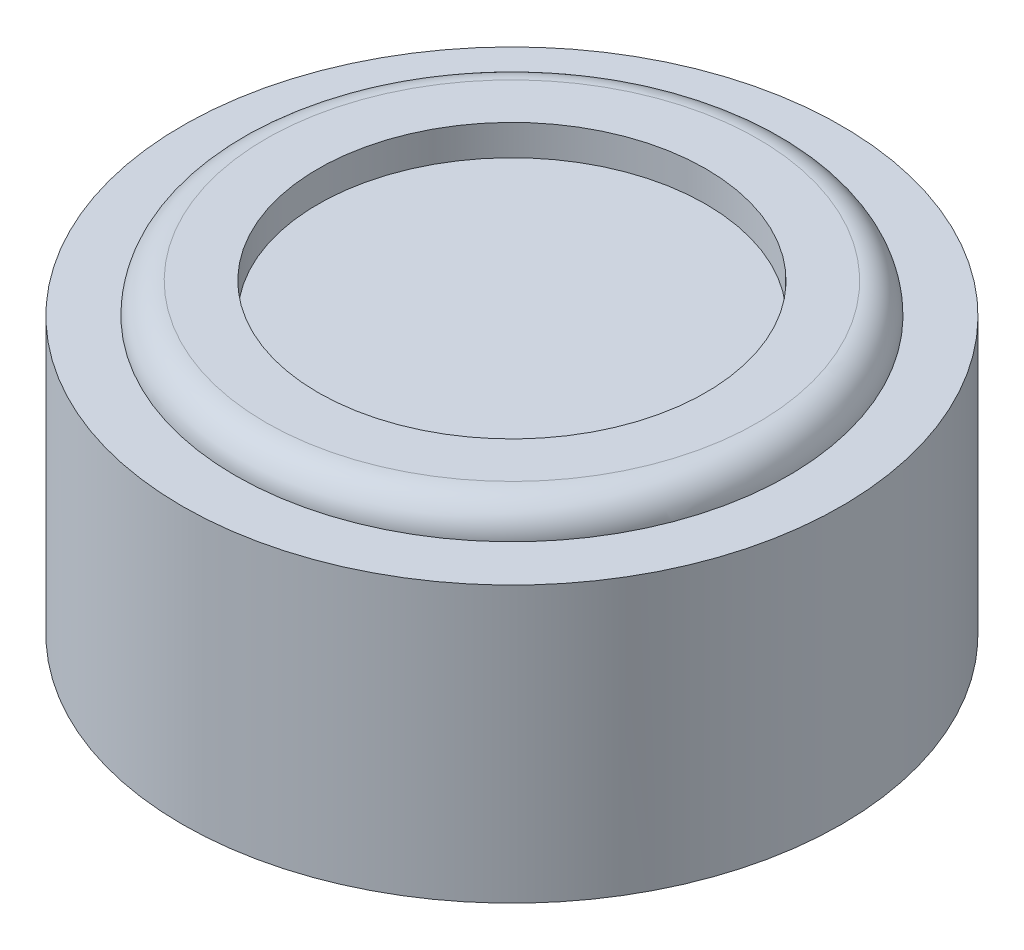
ISO-10303-21;
HEADER;
FILE_DESCRIPTION(('STEP AP214'),'2;1');
FILE_NAME('part.step','',(''),(''),'','','');
FILE_SCHEMA(('AUTOMOTIVE_DESIGN { 1 0 10303 214 1 1 1 1 }'));
ENDSEC;
DATA;
#1=APPLICATION_CONTEXT('core data for automotive mechanical design processes');
#2=APPLICATION_PROTOCOL_DEFINITION('international standard','automotive_design',2000,#1);
#3=PRODUCT_CONTEXT('',#1,'mechanical');
#4=PRODUCT('Part','Part','',(#3));
#5=PRODUCT_RELATED_PRODUCT_CATEGORY('part','',(#4));
#6=PRODUCT_DEFINITION_FORMATION('','',#4);
#7=PRODUCT_DEFINITION_CONTEXT('part definition',#1,'design');
#8=PRODUCT_DEFINITION('design','',#6,#7);
#9=PRODUCT_DEFINITION_SHAPE('','',#8);
#10=(LENGTH_UNIT() NAMED_UNIT(*) SI_UNIT(.MILLI.,.METRE.));
#11=(NAMED_UNIT(*) PLANE_ANGLE_UNIT() SI_UNIT($,.RADIAN.));
#12=(NAMED_UNIT(*) SI_UNIT($,.STERADIAN.) SOLID_ANGLE_UNIT());
#13=UNCERTAINTY_MEASURE_WITH_UNIT(LENGTH_MEASURE(1.E-05),#10,'distance_accuracy_value','');
#14=(GEOMETRIC_REPRESENTATION_CONTEXT(3) GLOBAL_UNCERTAINTY_ASSIGNED_CONTEXT((#13)) GLOBAL_UNIT_ASSIGNED_CONTEXT((#10,
#11,#12)) REPRESENTATION_CONTEXT('',''));
#15=CARTESIAN_POINT('',(0.,0.,0.));
#16=DIRECTION('',(0.,0.,1.));
#17=DIRECTION('',(1.,0.,0.));
#18=AXIS2_PLACEMENT_3D('',#15,#16,#17);
#19=CARTESIAN_POINT('',(0.,-16.5,0.));
#20=DIRECTION('',(0.,1.,0.));
#21=DIRECTION('',(0.,0.,1.));
#22=AXIS2_PLACEMENT_3D('',#19,#20,#21);
#23=CYLINDRICAL_SURFACE('',#22,16.15);
#24=CARTESIAN_POINT('',(0.,-1.5,0.));
#25=DIRECTION('',(0.,1.,0.));
#26=DIRECTION('',(0.,0.,1.));
#27=AXIS2_PLACEMENT_3D('',#24,#25,#26);
#28=CIRCLE('',#27,16.15);
#29=CARTESIAN_POINT('',(0.,-1.5,16.15));
#30=VERTEX_POINT('',#29);
#31=EDGE_CURVE('E40',#30,#30,#28,.F.);
#32=ORIENTED_EDGE('',*,*,#31,.T.);
#33=EDGE_LOOP('',(#32));
#34=FACE_BOUND('',#33,.T.);
#35=CARTESIAN_POINT('',(0.,-15.,0.));
#36=DIRECTION('',(0.,-1.,0.));
#37=DIRECTION('',(0.,0.,-1.));
#38=AXIS2_PLACEMENT_3D('',#35,#36,#37);
#39=CIRCLE('',#38,16.15);
#40=CARTESIAN_POINT('',(0.,-15.,-16.15));
#41=VERTEX_POINT('',#40);
#42=EDGE_CURVE('E53',#41,#41,#39,.F.);
#43=ORIENTED_EDGE('',*,*,#42,.T.);
#44=EDGE_LOOP('',(#43));
#45=FACE_BOUND('',#44,.T.);
#46=ADVANCED_FACE('F33',(#34,#45),#23,.T.);
#47=CARTESIAN_POINT('',(0.,-1.5,0.));
#48=DIRECTION('',(0.,1.,0.));
#49=DIRECTION('',(0.,0.,1.));
#50=AXIS2_PLACEMENT_3D('',#47,#48,#49);
#51=PLANE('',#50);
#52=ORIENTED_EDGE('',*,*,#31,.F.);
#53=EDGE_LOOP('',(#52));
#54=FACE_BOUND('',#53,.T.);
#55=CARTESIAN_POINT('',(0.,-1.5,0.));
#56=DIRECTION('',(0.,1.,0.));
#57=DIRECTION('',(0.,0.,1.));
#58=AXIS2_PLACEMENT_3D('',#55,#56,#57);
#59=CIRCLE('',#58,13.55);
#60=CARTESIAN_POINT('',(0.,-1.5,13.55));
#61=VERTEX_POINT('',#60);
#62=EDGE_CURVE('E44',#61,#61,#59,.T.);
#63=ORIENTED_EDGE('',*,*,#62,.F.);
#64=EDGE_LOOP('',(#63));
#65=FACE_BOUND('',#64,.T.);
#66=ADVANCED_FACE('F104',(#54,#65),#51,.T.);
#67=CARTESIAN_POINT('',(0.,0.,0.));
#68=DIRECTION('',(0.,1.,0.));
#69=DIRECTION('',(0.,0.,1.));
#70=AXIS2_PLACEMENT_3D('',#67,#68,#69);
#71=PLANE('',#70);
#72=CARTESIAN_POINT('',(0.,0.,0.));
#73=DIRECTION('',(0.,1.,0.));
#74=DIRECTION('',(0.,0.,1.));
#75=AXIS2_PLACEMENT_3D('',#72,#73,#74);
#76=CIRCLE('',#75,12.05);
#77=CARTESIAN_POINT('',(0.,0.,12.05));
#78=VERTEX_POINT('',#77);
#79=EDGE_CURVE('E11',#78,#78,#76,.T.);
#80=ORIENTED_EDGE('',*,*,#79,.T.);
#81=EDGE_LOOP('',(#80));
#82=FACE_BOUND('',#81,.T.);
#83=CARTESIAN_POINT('',(0.,0.,0.));
#84=DIRECTION('',(0.,1.,0.));
#85=DIRECTION('',(0.,0.,1.));
#86=AXIS2_PLACEMENT_3D('',#83,#84,#85);
#87=CIRCLE('',#86,9.5);
#88=CARTESIAN_POINT('',(0.,0.,9.5));
#89=VERTEX_POINT('',#88);
#90=EDGE_CURVE('E56',#89,#89,#87,.T.);
#91=ORIENTED_EDGE('',*,*,#90,.F.);
#92=EDGE_LOOP('',(#91));
#93=FACE_BOUND('',#92,.T.);
#94=ADVANCED_FACE('F102',(#82,#93),#71,.T.);
#95=CARTESIAN_POINT('',(0.,-1.5,0.));
#96=DIRECTION('',(0.,1.,0.));
#97=DIRECTION('',(0.,0.,1.));
#98=AXIS2_PLACEMENT_3D('',#95,#96,#97);
#99=CYLINDRICAL_SURFACE('',#98,9.5);
#100=CARTESIAN_POINT('',(0.,-1.5,0.));
#101=DIRECTION('',(0.,1.,0.));
#102=DIRECTION('',(0.,0.,1.));
#103=AXIS2_PLACEMENT_3D('',#100,#101,#102);
#104=CIRCLE('',#103,9.5);
#105=CARTESIAN_POINT('',(0.,-1.5,9.5));
#106=VERTEX_POINT('',#105);
#107=EDGE_CURVE('E49',#106,#106,#104,.T.);
#108=ORIENTED_EDGE('',*,*,#107,.F.);
#109=EDGE_LOOP('',(#108));
#110=FACE_BOUND('',#109,.T.);
#111=ORIENTED_EDGE('',*,*,#90,.T.);
#112=EDGE_LOOP('',(#111));
#113=FACE_BOUND('',#112,.T.);
#114=ADVANCED_FACE('F100',(#110,#113),#99,.F.);
#115=CARTESIAN_POINT('',(0.,-1.5,0.));
#116=DIRECTION('',(0.,1.,0.));
#117=DIRECTION('',(0.,0.,1.));
#118=AXIS2_PLACEMENT_3D('',#115,#116,#117);
#119=PLANE('',#118);
#120=ORIENTED_EDGE('',*,*,#107,.T.);
#121=EDGE_LOOP('',(#120));
#122=FACE_BOUND('',#121,.T.);
#123=ADVANCED_FACE('F110',(#122),#119,.T.);
#124=CARTESIAN_POINT('',(0.,-15.,0.));
#125=DIRECTION('',(0.,-1.,0.));
#126=DIRECTION('',(0.,0.,-1.));
#127=AXIS2_PLACEMENT_3D('',#124,#125,#126);
#128=PLANE('',#127);
#129=ORIENTED_EDGE('',*,*,#42,.F.);
#130=EDGE_LOOP('',(#129));
#131=FACE_BOUND('',#130,.T.);
#132=CARTESIAN_POINT('',(0.,-15.,0.));
#133=DIRECTION('',(0.,-1.,0.));
#134=DIRECTION('',(0.,0.,-1.));
#135=AXIS2_PLACEMENT_3D('',#132,#133,#134);
#136=CIRCLE('',#135,13.55);
#137=CARTESIAN_POINT('',(0.,-15.,-13.55));
#138=VERTEX_POINT('',#137);
#139=EDGE_CURVE('E57',#138,#138,#136,.T.);
#140=ORIENTED_EDGE('',*,*,#139,.F.);
#141=EDGE_LOOP('',(#140));
#142=FACE_BOUND('',#141,.T.);
#143=ADVANCED_FACE('F122',(#131,#142),#128,.T.);
#144=CARTESIAN_POINT('',(0.,-15.,0.));
#145=DIRECTION('',(0.,-1.,0.));
#146=DIRECTION('',(0.,0.,-1.));
#147=AXIS2_PLACEMENT_3D('',#144,#145,#146);
#148=CYLINDRICAL_SURFACE('',#147,13.55);
#149=ORIENTED_EDGE('',*,*,#139,.T.);
#150=EDGE_LOOP('',(#149));
#151=FACE_BOUND('',#150,.T.);
#152=CARTESIAN_POINT('',(0.,-16.5,0.));
#153=DIRECTION('',(0.,-1.,0.));
#154=DIRECTION('',(0.,0.,-1.));
#155=AXIS2_PLACEMENT_3D('',#152,#153,#154);
#156=CIRCLE('',#155,13.55);
#157=CARTESIAN_POINT('',(0.,-16.5,-13.55));
#158=VERTEX_POINT('',#157);
#159=EDGE_CURVE('E89',#158,#158,#156,.T.);
#160=ORIENTED_EDGE('',*,*,#159,.F.);
#161=EDGE_LOOP('',(#160));
#162=FACE_BOUND('',#161,.T.);
#163=ADVANCED_FACE('F125',(#151,#162),#148,.T.);
#164=CARTESIAN_POINT('',(0.,-16.5,0.));
#165=DIRECTION('',(0.,1.,0.));
#166=DIRECTION('',(0.,0.,1.));
#167=AXIS2_PLACEMENT_3D('',#164,#165,#166);
#168=PLANE('',#167);
#169=CARTESIAN_POINT('',(0.,-16.5,0.));
#170=DIRECTION('',(0.,-1.,0.));
#171=DIRECTION('',(0.,0.,-1.));
#172=AXIS2_PLACEMENT_3D('',#169,#170,#171);
#173=CIRCLE('',#172,12.);
#174=CARTESIAN_POINT('',(0.,-16.5,-12.));
#175=VERTEX_POINT('',#174);
#176=EDGE_CURVE('E61',#175,#175,#173,.T.);
#177=ORIENTED_EDGE('',*,*,#176,.F.);
#178=EDGE_LOOP('',(#177));
#179=FACE_BOUND('',#178,.T.);
#180=ORIENTED_EDGE('',*,*,#159,.T.);
#181=EDGE_LOOP('',(#180));
#182=FACE_BOUND('',#181,.T.);
#183=ADVANCED_FACE('F131',(#179,#182),#168,.F.);
#184=CARTESIAN_POINT('',(0.,-15.,0.));
#185=DIRECTION('',(0.,-1.,0.));
#186=DIRECTION('',(0.,0.,-1.));
#187=AXIS2_PLACEMENT_3D('',#184,#185,#186);
#188=CYLINDRICAL_SURFACE('',#187,12.);
#189=CARTESIAN_POINT('',(0.,-15.,0.));
#190=DIRECTION('',(0.,-1.,0.));
#191=DIRECTION('',(0.,0.,-1.));
#192=AXIS2_PLACEMENT_3D('',#189,#190,#191);
#193=CIRCLE('',#192,12.);
#194=CARTESIAN_POINT('',(0.,-15.,-12.));
#195=VERTEX_POINT('',#194);
#196=EDGE_CURVE('E86',#195,#195,#193,.T.);
#197=ORIENTED_EDGE('',*,*,#196,.F.);
#198=EDGE_LOOP('',(#197));
#199=FACE_BOUND('',#198,.T.);
#200=ORIENTED_EDGE('',*,*,#176,.T.);
#201=EDGE_LOOP('',(#200));
#202=FACE_BOUND('',#201,.T.);
#203=ADVANCED_FACE('F136',(#199,#202),#188,.F.);
#204=CARTESIAN_POINT('',(0.,-15.,0.));
#205=DIRECTION('',(0.,-1.,0.));
#206=DIRECTION('',(0.,0.,-1.));
#207=AXIS2_PLACEMENT_3D('',#204,#205,#206);
#208=PLANE('',#207);
#209=CARTESIAN_POINT('',(6.01040764008296,-15.,-6.01040764008835));
#210=DIRECTION('',(0.,-1.,0.));
#211=DIRECTION('',(0.,0.,-1.));
#212=AXIS2_PLACEMENT_3D('',#209,#210,#211);
#213=CIRCLE('',#212,1.39999999999645);
#214=CARTESIAN_POINT('',(6.01040764008296,-15.,-7.4104076400848));
#215=VERTEX_POINT('',#214);
#216=EDGE_CURVE('E70',#215,#215,#213,.T.);
#217=ORIENTED_EDGE('',*,*,#216,.F.);
#218=EDGE_LOOP('',(#217));
#219=FACE_BOUND('',#218,.T.);
#220=CARTESIAN_POINT('',(-6.01040764008604,-15.,-6.01040764008527));
#221=DIRECTION('',(0.,-1.,0.));
#222=DIRECTION('',(0.,0.,-1.));
#223=AXIS2_PLACEMENT_3D('',#220,#221,#222);
#224=CIRCLE('',#223,1.39999999999949);
#225=CARTESIAN_POINT('',(-6.01040764008604,-15.,-7.41040764008476));
#226=VERTEX_POINT('',#225);
#227=EDGE_CURVE('E67',#226,#226,#224,.T.);
#228=ORIENTED_EDGE('',*,*,#227,.F.);
#229=EDGE_LOOP('',(#228));
#230=FACE_BOUND('',#229,.T.);
#231=CARTESIAN_POINT('',(0.,-15.,8.5));
#232=DIRECTION('',(0.,-1.,0.));
#233=DIRECTION('',(0.,0.,-1.));
#234=AXIS2_PLACEMENT_3D('',#231,#232,#233);
#235=CIRCLE('',#234,1.4);
#236=CARTESIAN_POINT('',(0.,-15.,7.1));
#237=VERTEX_POINT('',#236);
#238=EDGE_CURVE('E63',#237,#237,#235,.T.);
#239=ORIENTED_EDGE('',*,*,#238,.F.);
#240=EDGE_LOOP('',(#239));
#241=FACE_BOUND('',#240,.T.);
#242=CARTESIAN_POINT('',(0.,-15.,-8.5));
#243=DIRECTION('',(0.,-1.,0.));
#244=DIRECTION('',(0.,0.,-1.));
#245=AXIS2_PLACEMENT_3D('',#242,#243,#244);
#246=CIRCLE('',#245,1.4);
#247=CARTESIAN_POINT('',(0.,-15.,-9.9));
#248=VERTEX_POINT('',#247);
#249=EDGE_CURVE('E58',#248,#248,#246,.T.);
#250=ORIENTED_EDGE('',*,*,#249,.F.);
#251=EDGE_LOOP('',(#250));
#252=FACE_BOUND('',#251,.T.);
#253=ORIENTED_EDGE('',*,*,#196,.T.);
#254=EDGE_LOOP('',(#253));
#255=FACE_BOUND('',#254,.T.);
#256=ADVANCED_FACE('F141',(#219,#230,#241,#252,#255),#208,.T.);
#257=CARTESIAN_POINT('',(0.,-14.,-8.5));
#258=DIRECTION('',(0.,-1.,0.));
#259=DIRECTION('',(0.,0.,-1.));
#260=AXIS2_PLACEMENT_3D('',#257,#258,#259);
#261=CYLINDRICAL_SURFACE('',#260,1.4);
#262=ORIENTED_EDGE('',*,*,#249,.T.);
#263=EDGE_LOOP('',(#262));
#264=FACE_BOUND('',#263,.T.);
#265=CARTESIAN_POINT('',(0.,-14.,-8.5));
#266=DIRECTION('',(0.,-1.,0.));
#267=DIRECTION('',(0.,0.,-1.));
#268=AXIS2_PLACEMENT_3D('',#265,#266,#267);
#269=CIRCLE('',#268,1.4);
#270=CARTESIAN_POINT('',(0.,-14.,-9.9));
#271=VERTEX_POINT('',#270);
#272=EDGE_CURVE('E62',#271,#271,#269,.T.);
#273=ORIENTED_EDGE('',*,*,#272,.F.);
#274=EDGE_LOOP('',(#273));
#275=FACE_BOUND('',#274,.T.);
#276=ADVANCED_FACE('F151',(#264,#275),#261,.F.);
#277=CARTESIAN_POINT('',(0.,-14.,-8.5));
#278=DIRECTION('',(0.,-1.,0.));
#279=DIRECTION('',(0.,0.,-1.));
#280=AXIS2_PLACEMENT_3D('',#277,#278,#279);
#281=PLANE('',#280);
#282=ORIENTED_EDGE('',*,*,#272,.T.);
#283=EDGE_LOOP('',(#282));
#284=FACE_BOUND('',#283,.T.);
#285=ADVANCED_FACE('F155',(#284),#281,.T.);
#286=CARTESIAN_POINT('',(0.,-14.,8.5));
#287=DIRECTION('',(0.,-1.,0.));
#288=DIRECTION('',(0.,0.,-1.));
#289=AXIS2_PLACEMENT_3D('',#286,#287,#288);
#290=CYLINDRICAL_SURFACE('',#289,1.4);
#291=ORIENTED_EDGE('',*,*,#238,.T.);
#292=EDGE_LOOP('',(#291));
#293=FACE_BOUND('',#292,.T.);
#294=CARTESIAN_POINT('',(0.,-14.,8.5));
#295=DIRECTION('',(0.,-1.,0.));
#296=DIRECTION('',(0.,0.,-1.));
#297=AXIS2_PLACEMENT_3D('',#294,#295,#296);
#298=CIRCLE('',#297,1.4);
#299=CARTESIAN_POINT('',(0.,-14.,7.1));
#300=VERTEX_POINT('',#299);
#301=EDGE_CURVE('E66',#300,#300,#298,.T.);
#302=ORIENTED_EDGE('',*,*,#301,.F.);
#303=EDGE_LOOP('',(#302));
#304=FACE_BOUND('',#303,.T.);
#305=ADVANCED_FACE('F159',(#293,#304),#290,.F.);
#306=CARTESIAN_POINT('',(0.,-14.,8.5));
#307=DIRECTION('',(0.,-1.,0.));
#308=DIRECTION('',(0.,0.,-1.));
#309=AXIS2_PLACEMENT_3D('',#306,#307,#308);
#310=PLANE('',#309);
#311=ORIENTED_EDGE('',*,*,#301,.T.);
#312=EDGE_LOOP('',(#311));
#313=FACE_BOUND('',#312,.T.);
#314=ADVANCED_FACE('F163',(#313),#310,.T.);
#315=CARTESIAN_POINT('',(-6.01040764008604,-14.,-6.01040764008527));
#316=DIRECTION('',(0.,-1.,0.));
#317=DIRECTION('',(0.,0.,-1.));
#318=AXIS2_PLACEMENT_3D('',#315,#316,#317);
#319=CYLINDRICAL_SURFACE('',#318,1.39999999999949);
#320=ORIENTED_EDGE('',*,*,#227,.T.);
#321=EDGE_LOOP('',(#320));
#322=FACE_BOUND('',#321,.T.);
#323=CARTESIAN_POINT('',(-6.01040764008604,-14.,-6.01040764008527));
#324=DIRECTION('',(0.,-1.,0.));
#325=DIRECTION('',(0.,0.,-1.));
#326=AXIS2_PLACEMENT_3D('',#323,#324,#325);
#327=CIRCLE('',#326,1.39999999999949);
#328=CARTESIAN_POINT('',(-6.01040764008604,-14.,-7.41040764008476));
#329=VERTEX_POINT('',#328);
#330=EDGE_CURVE('E69',#329,#329,#327,.T.);
#331=ORIENTED_EDGE('',*,*,#330,.F.);
#332=EDGE_LOOP('',(#331));
#333=FACE_BOUND('',#332,.T.);
#334=ADVANCED_FACE('F167',(#322,#333),#319,.F.);
#335=CARTESIAN_POINT('',(-6.01040764008604,-14.,-6.01040764008527));
#336=DIRECTION('',(0.,-1.,0.));
#337=DIRECTION('',(0.,0.,-1.));
#338=AXIS2_PLACEMENT_3D('',#335,#336,#337);
#339=PLANE('',#338);
#340=ORIENTED_EDGE('',*,*,#330,.T.);
#341=EDGE_LOOP('',(#340));
#342=FACE_BOUND('',#341,.T.);
#343=ADVANCED_FACE('F171',(#342),#339,.T.);
#344=CARTESIAN_POINT('',(6.01040764008296,-14.,-6.01040764008835));
#345=DIRECTION('',(0.,-1.,0.));
#346=DIRECTION('',(0.,0.,-1.));
#347=AXIS2_PLACEMENT_3D('',#344,#345,#346);
#348=CYLINDRICAL_SURFACE('',#347,1.39999999999645);
#349=ORIENTED_EDGE('',*,*,#216,.T.);
#350=EDGE_LOOP('',(#349));
#351=FACE_BOUND('',#350,.T.);
#352=CARTESIAN_POINT('',(6.01040764008296,-14.,-6.01040764008835));
#353=DIRECTION('',(0.,-1.,0.));
#354=DIRECTION('',(0.,0.,-1.));
#355=AXIS2_PLACEMENT_3D('',#352,#353,#354);
#356=CIRCLE('',#355,1.39999999999645);
#357=CARTESIAN_POINT('',(6.01040764008296,-14.,-7.4104076400848));
#358=VERTEX_POINT('',#357);
#359=EDGE_CURVE('E72',#358,#358,#356,.T.);
#360=ORIENTED_EDGE('',*,*,#359,.F.);
#361=EDGE_LOOP('',(#360));
#362=FACE_BOUND('',#361,.T.);
#363=ADVANCED_FACE('F175',(#351,#362),#348,.F.);
#364=CARTESIAN_POINT('',(6.01040764008296,-14.,-6.01040764008835));
#365=DIRECTION('',(0.,-1.,0.));
#366=DIRECTION('',(0.,0.,-1.));
#367=AXIS2_PLACEMENT_3D('',#364,#365,#366);
#368=PLANE('',#367);
#369=ORIENTED_EDGE('',*,*,#359,.T.);
#370=EDGE_LOOP('',(#369));
#371=FACE_BOUND('',#370,.T.);
#372=ADVANCED_FACE('F179',(#371),#368,.T.);
#373=CARTESIAN_POINT('',(0.,-1.5,0.));
#374=DIRECTION('',(0.,1.,0.));
#375=DIRECTION('',(0.,0.,1.));
#376=AXIS2_PLACEMENT_3D('',#373,#374,#375);
#377=TOROIDAL_SURFACE('',#376,12.05,1.5);
#378=ORIENTED_EDGE('',*,*,#62,.T.);
#379=EDGE_LOOP('',(#378));
#380=FACE_BOUND('',#379,.T.);
#381=ORIENTED_EDGE('',*,*,#79,.F.);
#382=EDGE_LOOP('',(#381));
#383=FACE_BOUND('',#382,.T.);
#384=ADVANCED_FACE('F35',(#380,#383),#377,.T.);
#385=CLOSED_SHELL('',(#46,#66,#94,#114,#123,#143,#163,#183,#203,#256,#276,#285,#305,#314,#334,
#343,#363,#372,#384));
#386=MANIFOLD_SOLID_BREP('B2',#385);
#387=ADVANCED_BREP_SHAPE_REPRESENTATION('',(#18,#386),#14);
#388=SHAPE_DEFINITION_REPRESENTATION(#9,#387);
ENDSEC;
END-ISO-10303-21;
